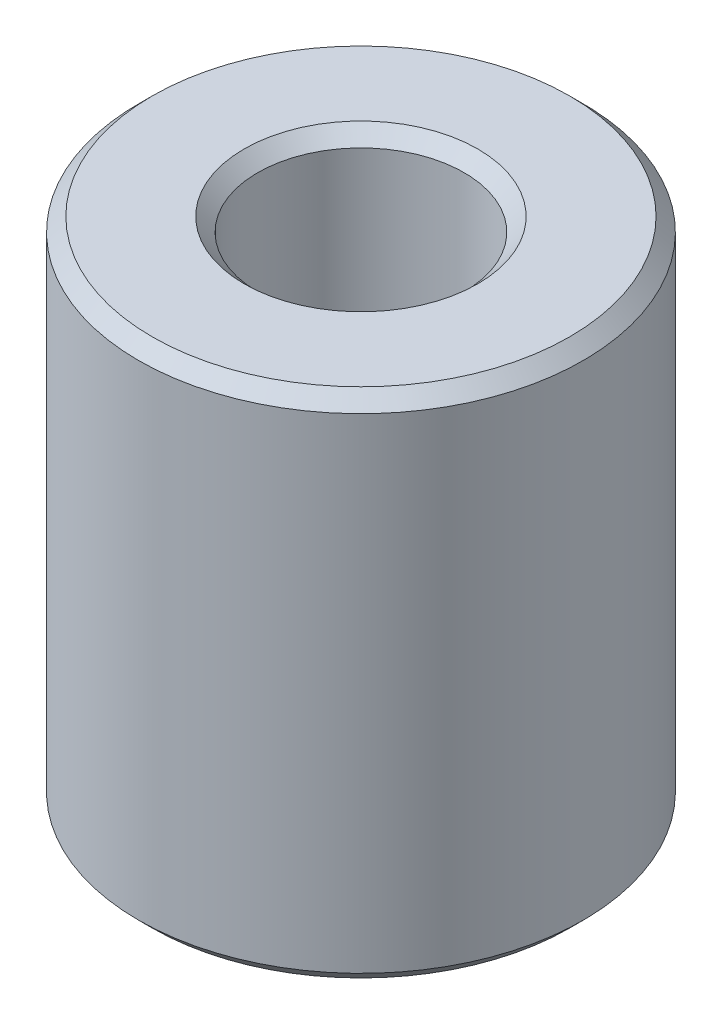
ISO-10303-21;
HEADER;
FILE_DESCRIPTION(('STEP AP214'),'2;1');
FILE_NAME('part.step','',(''),(''),'','','');
FILE_SCHEMA(('AUTOMOTIVE_DESIGN { 1 0 10303 214 1 1 1 1 }'));
ENDSEC;
DATA;
#1=APPLICATION_CONTEXT('core data for automotive mechanical design processes');
#2=APPLICATION_PROTOCOL_DEFINITION('international standard','automotive_design',2000,#1);
#3=PRODUCT_CONTEXT('',#1,'mechanical');
#4=PRODUCT('Part','Part','',(#3));
#5=PRODUCT_RELATED_PRODUCT_CATEGORY('part','',(#4));
#6=PRODUCT_DEFINITION_FORMATION('','',#4);
#7=PRODUCT_DEFINITION_CONTEXT('part definition',#1,'design');
#8=PRODUCT_DEFINITION('design','',#6,#7);
#9=PRODUCT_DEFINITION_SHAPE('','',#8);
#10=(LENGTH_UNIT() NAMED_UNIT(*) SI_UNIT(.MILLI.,.METRE.));
#11=(NAMED_UNIT(*) PLANE_ANGLE_UNIT() SI_UNIT($,.RADIAN.));
#12=(NAMED_UNIT(*) SI_UNIT($,.STERADIAN.) SOLID_ANGLE_UNIT());
#13=UNCERTAINTY_MEASURE_WITH_UNIT(LENGTH_MEASURE(1.E-05),#10,'distance_accuracy_value','');
#14=(GEOMETRIC_REPRESENTATION_CONTEXT(3) GLOBAL_UNCERTAINTY_ASSIGNED_CONTEXT((#13)) GLOBAL_UNIT_ASSIGNED_CONTEXT((#10,
#11,#12)) REPRESENTATION_CONTEXT('',''));
#15=CARTESIAN_POINT('',(0.,0.,0.));
#16=DIRECTION('',(0.,0.,1.));
#17=DIRECTION('',(1.,0.,0.));
#18=AXIS2_PLACEMENT_3D('',#15,#16,#17);
#19=CARTESIAN_POINT('',(0.,23.0281574587311,0.));
#20=DIRECTION('',(0.,-1.,0.));
#21=DIRECTION('',(0.,0.,-1.));
#22=AXIS2_PLACEMENT_3D('',#19,#20,#21);
#23=CYLINDRICAL_SURFACE('',#22,10.);
#24=CARTESIAN_POINT('',(0.,0.614186939483136,0.));
#25=DIRECTION('',(0.,1.,0.));
#26=DIRECTION('',(0.,0.,1.));
#27=AXIS2_PLACEMENT_3D('',#24,#25,#26);
#28=CIRCLE('',#27,10.);
#29=CARTESIAN_POINT('',(0.,0.614186939483136,10.));
#30=VERTEX_POINT('',#29);
#31=EDGE_CURVE('E10',#30,#30,#28,.T.);
#32=ORIENTED_EDGE('',*,*,#31,.T.);
#33=EDGE_LOOP('',(#32));
#34=FACE_BOUND('',#33,.T.);
#35=CARTESIAN_POINT('',(0.,22.4139705192479,0.));
#36=DIRECTION('',(0.,1.,0.));
#37=DIRECTION('',(0.,0.,1.));
#38=AXIS2_PLACEMENT_3D('',#35,#36,#37);
#39=CIRCLE('',#38,10.);
#40=CARTESIAN_POINT('',(0.,22.4139705192479,10.));
#41=VERTEX_POINT('',#40);
#42=EDGE_CURVE('E50',#41,#41,#39,.F.);
#43=ORIENTED_EDGE('',*,*,#42,.T.);
#44=EDGE_LOOP('',(#43));
#45=FACE_BOUND('',#44,.T.);
#46=ADVANCED_FACE('F39',(#34,#45),#23,.T.);
#47=CARTESIAN_POINT('',(0.,23.0281574587311,0.));
#48=DIRECTION('',(0.,1.,0.));
#49=DIRECTION('',(0.,0.,1.));
#50=AXIS2_PLACEMENT_3D('',#47,#48,#49);
#51=PLANE('',#50);
#52=CARTESIAN_POINT('',(0.,23.0281574587311,0.));
#53=DIRECTION('',(0.,1.,0.));
#54=DIRECTION('',(0.,0.,1.));
#55=AXIS2_PLACEMENT_3D('',#52,#53,#54);
#56=CIRCLE('',#55,5.25501555066665);
#57=CARTESIAN_POINT('',(0.,23.0281574587311,5.25501555066665));
#58=VERTEX_POINT('',#57);
#59=EDGE_CURVE('E58',#58,#58,#56,.F.);
#60=ORIENTED_EDGE('',*,*,#59,.T.);
#61=EDGE_LOOP('',(#60));
#62=FACE_BOUND('',#61,.T.);
#63=CARTESIAN_POINT('',(0.,23.0281574587311,0.));
#64=DIRECTION('',(0.,1.,0.));
#65=DIRECTION('',(0.,0.,1.));
#66=AXIS2_PLACEMENT_3D('',#63,#64,#65);
#67=CIRCLE('',#66,9.38581306051686);
#68=CARTESIAN_POINT('',(0.,23.0281574587311,9.38581306051686));
#69=VERTEX_POINT('',#68);
#70=EDGE_CURVE('E61',#69,#69,#67,.T.);
#71=ORIENTED_EDGE('',*,*,#70,.T.);
#72=EDGE_LOOP('',(#71));
#73=FACE_BOUND('',#72,.T.);
#74=ADVANCED_FACE('F88',(#62,#73),#51,.T.);
#75=CARTESIAN_POINT('',(0.,0.,0.));
#76=DIRECTION('',(0.,1.,0.));
#77=DIRECTION('',(0.,0.,1.));
#78=AXIS2_PLACEMENT_3D('',#75,#76,#77);
#79=PLANE('',#78);
#80=CARTESIAN_POINT('',(0.,0.,0.));
#81=DIRECTION('',(0.,1.,0.));
#82=DIRECTION('',(0.,0.,1.));
#83=AXIS2_PLACEMENT_3D('',#80,#81,#82);
#84=CIRCLE('',#83,5.25501555066665);
#85=CARTESIAN_POINT('',(0.,0.,5.25501555066665));
#86=VERTEX_POINT('',#85);
#87=EDGE_CURVE('E51',#86,#86,#84,.T.);
#88=ORIENTED_EDGE('',*,*,#87,.T.);
#89=EDGE_LOOP('',(#88));
#90=FACE_BOUND('',#89,.T.);
#91=CARTESIAN_POINT('',(0.,0.,0.));
#92=DIRECTION('',(0.,1.,0.));
#93=DIRECTION('',(0.,0.,1.));
#94=AXIS2_PLACEMENT_3D('',#91,#92,#93);
#95=CIRCLE('',#94,9.38581306051686);
#96=CARTESIAN_POINT('',(0.,0.,9.38581306051686));
#97=VERTEX_POINT('',#96);
#98=EDGE_CURVE('E54',#97,#97,#95,.F.);
#99=ORIENTED_EDGE('',*,*,#98,.T.);
#100=EDGE_LOOP('',(#99));
#101=FACE_BOUND('',#100,.T.);
#102=ADVANCED_FACE('F83',(#90,#101),#79,.F.);
#103=CARTESIAN_POINT('',(0.,23.0281574587311,0.));
#104=DIRECTION('',(0.,-1.,0.));
#105=DIRECTION('',(0.,0.,-1.));
#106=AXIS2_PLACEMENT_3D('',#103,#104,#105);
#107=CYLINDRICAL_SURFACE('',#106,4.64082861118351);
#108=CARTESIAN_POINT('',(0.,22.4139705192479,0.));
#109=DIRECTION('',(0.,1.,0.));
#110=DIRECTION('',(0.,0.,1.));
#111=AXIS2_PLACEMENT_3D('',#108,#109,#110);
#112=CIRCLE('',#111,4.64082861118351);
#113=CARTESIAN_POINT('',(0.,22.4139705192479,4.64082861118351));
#114=VERTEX_POINT('',#113);
#115=EDGE_CURVE('E67',#114,#114,#112,.T.);
#116=ORIENTED_EDGE('',*,*,#115,.T.);
#117=EDGE_LOOP('',(#116));
#118=FACE_BOUND('',#117,.T.);
#119=CARTESIAN_POINT('',(0.,0.61418693948314,0.));
#120=DIRECTION('',(0.,1.,0.));
#121=DIRECTION('',(0.,0.,1.));
#122=AXIS2_PLACEMENT_3D('',#119,#120,#121);
#123=CIRCLE('',#122,4.64082861118351);
#124=CARTESIAN_POINT('',(0.,0.61418693948314,4.64082861118351));
#125=VERTEX_POINT('',#124);
#126=EDGE_CURVE('E69',#125,#125,#123,.F.);
#127=ORIENTED_EDGE('',*,*,#126,.T.);
#128=EDGE_LOOP('',(#127));
#129=FACE_BOUND('',#128,.T.);
#130=ADVANCED_FACE('F71',(#118,#129),#107,.F.);
#131=CARTESIAN_POINT('',(0.,22.4139705192479,0.));
#132=DIRECTION('',(0.,1.,0.));
#133=DIRECTION('',(0.,0.,1.));
#134=AXIS2_PLACEMENT_3D('',#131,#132,#133);
#135=CONICAL_SURFACE('',#134,4.64082861118351,0.785398163397454);
#136=ORIENTED_EDGE('',*,*,#59,.F.);
#137=EDGE_LOOP('',(#136));
#138=FACE_BOUND('',#137,.T.);
#139=ORIENTED_EDGE('',*,*,#115,.F.);
#140=EDGE_LOOP('',(#139));
#141=FACE_BOUND('',#140,.T.);
#142=ADVANCED_FACE('F77',(#138,#141),#135,.F.);
#143=CARTESIAN_POINT('',(0.,0.,0.));
#144=DIRECTION('',(0.,-1.,0.));
#145=DIRECTION('',(0.,0.,-1.));
#146=AXIS2_PLACEMENT_3D('',#143,#144,#145);
#147=CONICAL_SURFACE('',#146,5.25501555066665,0.785398163397448);
#148=ORIENTED_EDGE('',*,*,#126,.F.);
#149=EDGE_LOOP('',(#148));
#150=FACE_BOUND('',#149,.T.);
#151=ORIENTED_EDGE('',*,*,#87,.F.);
#152=EDGE_LOOP('',(#151));
#153=FACE_BOUND('',#152,.T.);
#154=ADVANCED_FACE('F73',(#150,#153),#147,.F.);
#155=CARTESIAN_POINT('',(0.,0.614186939483136,0.));
#156=DIRECTION('',(0.,1.,0.));
#157=DIRECTION('',(0.,0.,1.));
#158=AXIS2_PLACEMENT_3D('',#155,#156,#157);
#159=CONICAL_SURFACE('',#158,10.,0.785398163397454);
#160=ORIENTED_EDGE('',*,*,#98,.F.);
#161=EDGE_LOOP('',(#160));
#162=FACE_BOUND('',#161,.T.);
#163=ORIENTED_EDGE('',*,*,#31,.F.);
#164=EDGE_LOOP('',(#163));
#165=FACE_BOUND('',#164,.T.);
#166=ADVANCED_FACE('F76',(#162,#165),#159,.T.);
#167=CARTESIAN_POINT('',(0.,23.0281574587311,0.));
#168=DIRECTION('',(0.,-1.,0.));
#169=DIRECTION('',(0.,0.,-1.));
#170=AXIS2_PLACEMENT_3D('',#167,#168,#169);
#171=CONICAL_SURFACE('',#170,9.38581306051686,0.785398163397448);
#172=ORIENTED_EDGE('',*,*,#42,.F.);
#173=EDGE_LOOP('',(#172));
#174=FACE_BOUND('',#173,.T.);
#175=ORIENTED_EDGE('',*,*,#70,.F.);
#176=EDGE_LOOP('',(#175));
#177=FACE_BOUND('',#176,.T.);
#178=ADVANCED_FACE('F45',(#174,#177),#171,.T.);
#179=CLOSED_SHELL('',(#46,#74,#102,#130,#142,#154,#166,#178));
#180=MANIFOLD_SOLID_BREP('B2',#179);
#181=ADVANCED_BREP_SHAPE_REPRESENTATION('',(#18,#180),#14);
#182=SHAPE_DEFINITION_REPRESENTATION(#9,#181);
ENDSEC;
END-ISO-10303-21;
